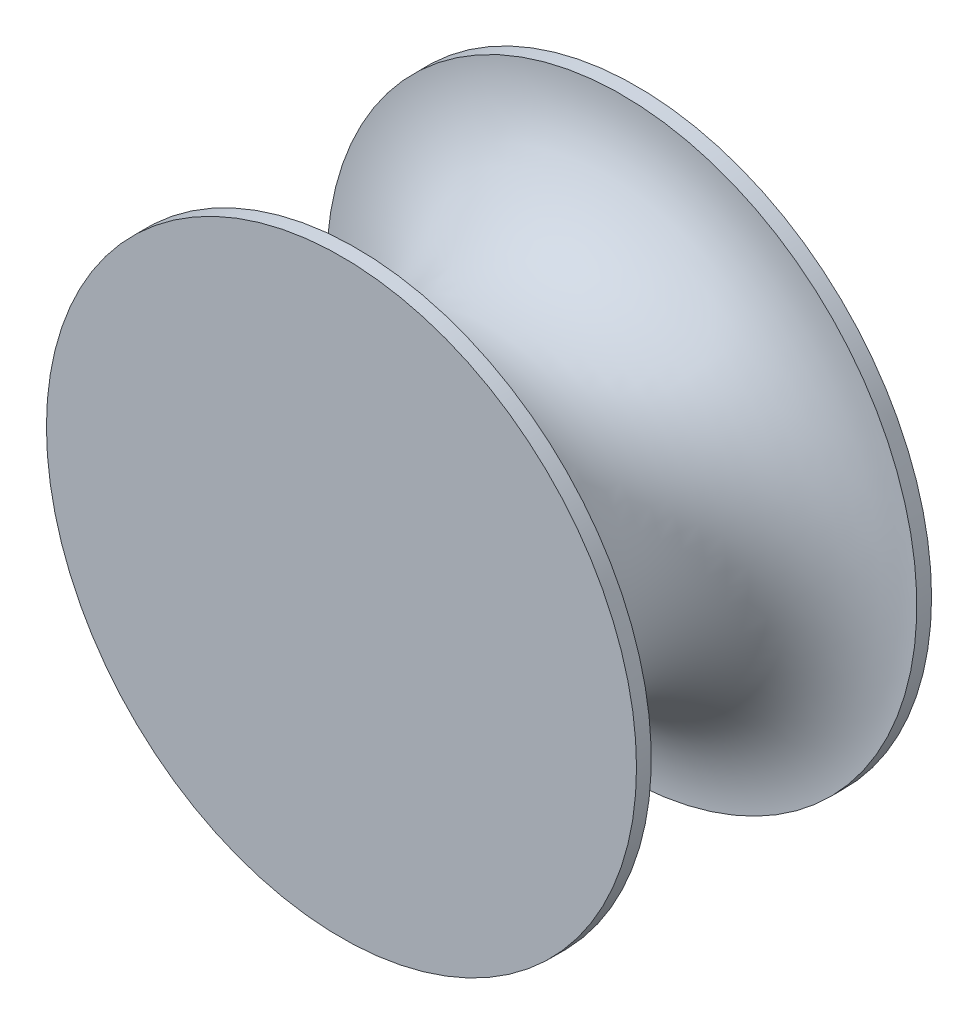
ISO-10303-21;
HEADER;
FILE_DESCRIPTION(('STEP AP214'),'2;1');
FILE_NAME('part.step','',(''),(''),'','','');
FILE_SCHEMA(('AUTOMOTIVE_DESIGN { 1 0 10303 214 1 1 1 1 }'));
ENDSEC;
DATA;
#1=APPLICATION_CONTEXT('core data for automotive mechanical design processes');
#2=APPLICATION_PROTOCOL_DEFINITION('international standard','automotive_design',2000,#1);
#3=PRODUCT_CONTEXT('',#1,'mechanical');
#4=PRODUCT('Part','Part','',(#3));
#5=PRODUCT_RELATED_PRODUCT_CATEGORY('part','',(#4));
#6=PRODUCT_DEFINITION_FORMATION('','',#4);
#7=PRODUCT_DEFINITION_CONTEXT('part definition',#1,'design');
#8=PRODUCT_DEFINITION('design','',#6,#7);
#9=PRODUCT_DEFINITION_SHAPE('','',#8);
#10=(LENGTH_UNIT() NAMED_UNIT(*) SI_UNIT(.MILLI.,.METRE.));
#11=(NAMED_UNIT(*) PLANE_ANGLE_UNIT() SI_UNIT($,.RADIAN.));
#12=(NAMED_UNIT(*) SI_UNIT($,.STERADIAN.) SOLID_ANGLE_UNIT());
#13=UNCERTAINTY_MEASURE_WITH_UNIT(LENGTH_MEASURE(1.E-05),#10,'distance_accuracy_value','');
#14=(GEOMETRIC_REPRESENTATION_CONTEXT(3) GLOBAL_UNCERTAINTY_ASSIGNED_CONTEXT((#13)) GLOBAL_UNIT_ASSIGNED_CONTEXT((#10,
#11,#12)) REPRESENTATION_CONTEXT('',''));
#15=CARTESIAN_POINT('',(0.,0.,0.));
#16=DIRECTION('',(0.,0.,1.));
#17=DIRECTION('',(1.,0.,0.));
#18=AXIS2_PLACEMENT_3D('',#15,#16,#17);
#19=CARTESIAN_POINT('',(0.,0.,12.7));
#20=DIRECTION('',(0.,0.,-1.));
#21=DIRECTION('',(-1.,0.,0.));
#22=AXIS2_PLACEMENT_3D('',#19,#20,#21);
#23=CYLINDRICAL_SURFACE('',#22,12.7);
#24=CARTESIAN_POINT('',(0.,0.,0.635));
#25=DIRECTION('',(0.,0.,-1.));
#26=DIRECTION('',(-1.,0.,0.));
#27=AXIS2_PLACEMENT_3D('',#24,#25,#26);
#28=CIRCLE('',#27,12.7);
#29=CARTESIAN_POINT('',(-12.7,0.,0.635));
#30=VERTEX_POINT('',#29);
#31=EDGE_CURVE('E46',#30,#30,#28,.T.);
#32=ORIENTED_EDGE('',*,*,#31,.T.);
#33=EDGE_LOOP('',(#32));
#34=FACE_BOUND('',#33,.T.);
#35=CARTESIAN_POINT('',(0.,0.,0.));
#36=DIRECTION('',(0.,0.,1.));
#37=DIRECTION('',(1.,0.,0.));
#38=AXIS2_PLACEMENT_3D('',#35,#36,#37);
#39=CIRCLE('',#38,12.7);
#40=CARTESIAN_POINT('',(12.7,0.,0.));
#41=VERTEX_POINT('',#40);
#42=EDGE_CURVE('E39',#41,#41,#39,.T.);
#43=ORIENTED_EDGE('',*,*,#42,.T.);
#44=EDGE_LOOP('',(#43));
#45=FACE_BOUND('',#44,.T.);
#46=ADVANCED_FACE('F35',(#34,#45),#23,.T.);
#47=CARTESIAN_POINT('',(0.,0.,0.));
#48=DIRECTION('',(0.,0.,1.));
#49=DIRECTION('',(1.,0.,0.));
#50=AXIS2_PLACEMENT_3D('',#47,#48,#49);
#51=PLANE('',#50);
#52=ORIENTED_EDGE('',*,*,#42,.F.);
#53=EDGE_LOOP('',(#52));
#54=FACE_BOUND('',#53,.T.);
#55=ADVANCED_FACE('F64',(#54),#51,.F.);
#56=CARTESIAN_POINT('',(0.,0.,6.35));
#57=DIRECTION('',(0.,0.,-1.));
#58=DIRECTION('',(-1.,0.,0.));
#59=AXIS2_PLACEMENT_3D('',#56,#57,#58);
#60=TOROIDAL_SURFACE('',#59,12.7,5.715);
#61=ORIENTED_EDGE('',*,*,#31,.F.);
#62=EDGE_LOOP('',(#61));
#63=FACE_BOUND('',#62,.T.);
#64=CARTESIAN_POINT('',(0.,0.,12.065));
#65=DIRECTION('',(0.,0.,-1.));
#66=DIRECTION('',(-1.,0.,0.));
#67=AXIS2_PLACEMENT_3D('',#64,#65,#66);
#68=CIRCLE('',#67,12.7);
#69=CARTESIAN_POINT('',(-12.7,0.,12.065));
#70=VERTEX_POINT('',#69);
#71=EDGE_CURVE('E50',#70,#70,#68,.T.);
#72=ORIENTED_EDGE('',*,*,#71,.T.);
#73=EDGE_LOOP('',(#72));
#74=FACE_BOUND('',#73,.T.);
#75=ADVANCED_FACE('F54',(#63,#74),#60,.F.);
#76=CARTESIAN_POINT('',(0.,0.,12.7));
#77=DIRECTION('',(0.,0.,1.));
#78=DIRECTION('',(1.,0.,0.));
#79=AXIS2_PLACEMENT_3D('',#76,#77,#78);
#80=PLANE('',#79);
#81=CARTESIAN_POINT('',(0.,0.,12.7));
#82=DIRECTION('',(0.,0.,1.));
#83=DIRECTION('',(1.,0.,0.));
#84=AXIS2_PLACEMENT_3D('',#81,#82,#83);
#85=CIRCLE('',#84,12.7);
#86=CARTESIAN_POINT('',(12.7,0.,12.7));
#87=VERTEX_POINT('',#86);
#88=EDGE_CURVE('E10',#87,#87,#85,.T.);
#89=ORIENTED_EDGE('',*,*,#88,.T.);
#90=EDGE_LOOP('',(#89));
#91=FACE_BOUND('',#90,.T.);
#92=ADVANCED_FACE('F58',(#91),#80,.T.);
#93=ORIENTED_EDGE('',*,*,#71,.F.);
#94=EDGE_LOOP('',(#93));
#95=FACE_BOUND('',#94,.T.);
#96=ORIENTED_EDGE('',*,*,#88,.F.);
#97=EDGE_LOOP('',(#96));
#98=FACE_BOUND('',#97,.T.);
#99=ADVANCED_FACE('F37',(#95,#98),#23,.T.);
#100=CLOSED_SHELL('',(#46,#55,#75,#92,#99));
#101=MANIFOLD_SOLID_BREP('B2',#100);
#102=ADVANCED_BREP_SHAPE_REPRESENTATION('',(#18,#101),#14);
#103=SHAPE_DEFINITION_REPRESENTATION(#9,#102);
ENDSEC;
END-ISO-10303-21;
